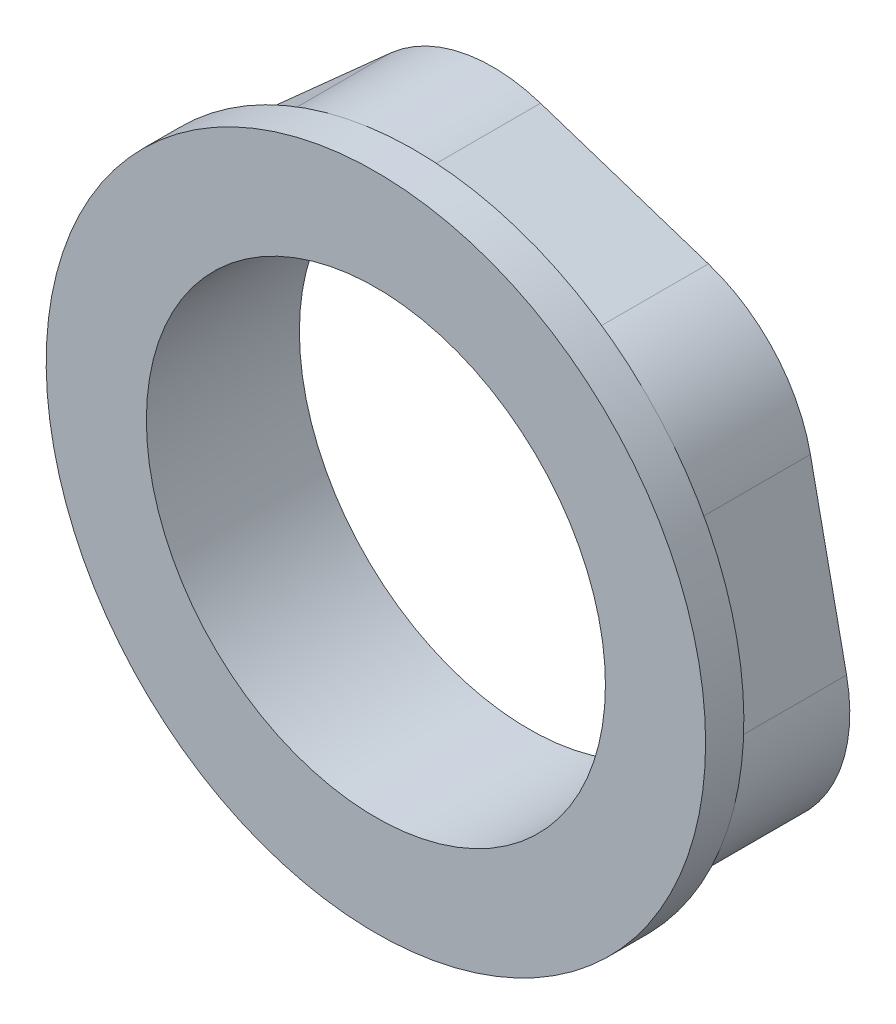
ISO-10303-21;
HEADER;
FILE_DESCRIPTION(('STEP AP214'),'2;1');
FILE_NAME('part.step','',(''),(''),'','','');
FILE_SCHEMA(('AUTOMOTIVE_DESIGN { 1 0 10303 214 1 1 1 1 }'));
ENDSEC;
DATA;
#1=APPLICATION_CONTEXT('core data for automotive mechanical design processes');
#2=APPLICATION_PROTOCOL_DEFINITION('international standard','automotive_design',2000,#1);
#3=PRODUCT_CONTEXT('',#1,'mechanical');
#4=PRODUCT('Part','Part','',(#3));
#5=PRODUCT_RELATED_PRODUCT_CATEGORY('part','',(#4));
#6=PRODUCT_DEFINITION_FORMATION('','',#4);
#7=PRODUCT_DEFINITION_CONTEXT('part definition',#1,'design');
#8=PRODUCT_DEFINITION('design','',#6,#7);
#9=PRODUCT_DEFINITION_SHAPE('','',#8);
#10=(LENGTH_UNIT() NAMED_UNIT(*) SI_UNIT(.MILLI.,.METRE.));
#11=(NAMED_UNIT(*) PLANE_ANGLE_UNIT() SI_UNIT($,.RADIAN.));
#12=(NAMED_UNIT(*) SI_UNIT($,.STERADIAN.) SOLID_ANGLE_UNIT());
#13=UNCERTAINTY_MEASURE_WITH_UNIT(LENGTH_MEASURE(1.E-05),#10,'distance_accuracy_value','');
#14=(GEOMETRIC_REPRESENTATION_CONTEXT(3) GLOBAL_UNCERTAINTY_ASSIGNED_CONTEXT((#13)) GLOBAL_UNIT_ASSIGNED_CONTEXT((#10,
#11,#12)) REPRESENTATION_CONTEXT('',''));
#15=CARTESIAN_POINT('',(0.,0.,0.));
#16=DIRECTION('',(0.,0.,1.));
#17=DIRECTION('',(1.,0.,0.));
#18=AXIS2_PLACEMENT_3D('',#15,#16,#17);
#19=CARTESIAN_POINT('',(0.,0.,0.));
#20=DIRECTION('',(0.,0.,1.));
#21=DIRECTION('',(1.,0.,0.));
#22=AXIS2_PLACEMENT_3D('',#19,#20,#21);
#23=PLANE('',#22);
#24=DIRECTION('',(-0.745360779799942,-0.666661314263864,0.));
#25=VECTOR('',#24,1.);
#26=CARTESIAN_POINT('',(-4.72654134805958,22.6051573809699,0.));
#27=LINE('',#26,#25);
#28=CARTESIAN_POINT('',(-9.02988381666844,18.7561864884844,0.));
#29=VERTEX_POINT('',#28);
#30=CARTESIAN_POINT('',(-17.6365687538861,11.0582447035133,0.));
#31=VERTEX_POINT('',#30);
#32=EDGE_CURVE('E237',#29,#31,#27,.T.);
#33=ORIENTED_EDGE('',*,*,#32,.F.);
#34=CARTESIAN_POINT('',(-2.3632706740298,11.3025786904849,0.));
#35=DIRECTION('',(0.,0.,1.));
#36=DIRECTION('',(1.,0.,0.));
#37=AXIS2_PLACEMENT_3D('',#34,#35,#36);
#38=CIRCLE('',#37,10.);
#39=CARTESIAN_POINT('',(0.758436457564168,20.8028389282129,0.));
#40=VERTEX_POINT('',#39);
#41=EDGE_CURVE('E153',#29,#40,#38,.F.);
#42=ORIENTED_EDGE('',*,*,#41,.T.);
#43=DIRECTION('',(-0.950026023772798,0.312170713159396,0.));
#44=VECTOR('',#43,1.);
#45=CARTESIAN_POINT('',(17.2133698744354,15.3958835699421,0.));
#46=LINE('',#45,#44);
#47=CARTESIAN_POINT('',(11.7283920688117,17.198202022699,0.));
#48=VERTEX_POINT('',#47);
#49=EDGE_CURVE('E235',#48,#40,#46,.T.);
#50=ORIENTED_EDGE('',*,*,#49,.F.);
#51=CARTESIAN_POINT('',(8.60668493721771,7.69794178497103,0.));
#52=DIRECTION('',(0.,0.,1.));
#53=DIRECTION('',(1.,0.,0.));
#54=AXIS2_PLACEMENT_3D('',#51,#52,#53);
#55=CIRCLE('',#54,10.);
#56=CARTESIAN_POINT('',(18.3950052114503,9.74459422469961,0.));
#57=VERTEX_POINT('',#56);
#58=EDGE_CURVE('E148',#48,#57,#55,.F.);
#59=ORIENTED_EDGE('',*,*,#58,.T.);
#60=DIRECTION('',(-0.204665243972857,0.978832027423261,0.));
#61=VECTOR('',#60,1.);
#62=CARTESIAN_POINT('',(21.939911222495,-7.20927381102781,0.));
#63=LINE('',#62,#61);
#64=CARTESIAN_POINT('',(20.7582758854801,-1.55798446578534,0.));
#65=VERTEX_POINT('',#64);
#66=EDGE_CURVE('E209',#65,#57,#63,.T.);
#67=ORIENTED_EDGE('',*,*,#66,.F.);
#68=CARTESIAN_POINT('',(10.9699556112475,-3.60463690551391,0.));
#69=DIRECTION('',(0.,0.,1.));
#70=DIRECTION('',(1.,0.,0.));
#71=AXIS2_PLACEMENT_3D('',#68,#69,#70);
#72=CIRCLE('',#71,10.);
#73=CARTESIAN_POINT('',(17.6365687538861,-11.0582447035133,0.));
#74=VERTEX_POINT('',#73);
#75=EDGE_CURVE('E248',#65,#74,#72,.F.);
#76=ORIENTED_EDGE('',*,*,#75,.T.);
#77=DIRECTION('',(0.745360779799942,0.666661314263864,0.));
#78=VECTOR('',#77,1.);
#79=CARTESIAN_POINT('',(4.72654134805957,-22.6051573809699,0.));
#80=LINE('',#79,#78);
#81=CARTESIAN_POINT('',(9.02988381666843,-18.7561864884844,0.));
#82=VERTEX_POINT('',#81);
#83=EDGE_CURVE('E230',#82,#74,#80,.T.);
#84=ORIENTED_EDGE('',*,*,#83,.F.);
#85=CARTESIAN_POINT('',(2.36327067402979,-11.3025786904849,0.));
#86=DIRECTION('',(0.,0.,1.));
#87=DIRECTION('',(1.,0.,0.));
#88=AXIS2_PLACEMENT_3D('',#85,#86,#87);
#89=CIRCLE('',#88,10.);
#90=CARTESIAN_POINT('',(-0.758436457564179,-20.8028389282129,0.));
#91=VERTEX_POINT('',#90);
#92=EDGE_CURVE('E250',#82,#91,#89,.F.);
#93=ORIENTED_EDGE('',*,*,#92,.T.);
#94=DIRECTION('',(0.950026023772798,-0.312170713159396,0.));
#95=VECTOR('',#94,1.);
#96=CARTESIAN_POINT('',(-17.2133698744354,-15.3958835699421,0.));
#97=LINE('',#96,#95);
#98=CARTESIAN_POINT('',(-11.7283920688117,-17.198202022699,0.));
#99=VERTEX_POINT('',#98);
#100=EDGE_CURVE('E227',#99,#91,#97,.T.);
#101=ORIENTED_EDGE('',*,*,#100,.F.);
#102=CARTESIAN_POINT('',(-8.60668493721772,-7.69794178497103,0.));
#103=DIRECTION('',(0.,0.,1.));
#104=DIRECTION('',(1.,0.,0.));
#105=AXIS2_PLACEMENT_3D('',#102,#103,#104);
#106=CIRCLE('',#105,10.);
#107=CARTESIAN_POINT('',(-18.3950052114503,-9.74459422469961,0.));
#108=VERTEX_POINT('',#107);
#109=EDGE_CURVE('E252',#99,#108,#106,.F.);
#110=ORIENTED_EDGE('',*,*,#109,.T.);
#111=DIRECTION('',(0.204665243972857,-0.978832027423261,0.));
#112=VECTOR('',#111,1.);
#113=CARTESIAN_POINT('',(-21.939911222495,7.20927381102781,0.));
#114=LINE('',#113,#112);
#115=CARTESIAN_POINT('',(-20.7582758854801,1.55798446578534,0.));
#116=VERTEX_POINT('',#115);
#117=EDGE_CURVE('E240',#116,#108,#114,.T.);
#118=ORIENTED_EDGE('',*,*,#117,.F.);
#119=CARTESIAN_POINT('',(-10.9699556112475,3.60463690551391,0.));
#120=DIRECTION('',(0.,0.,1.));
#121=DIRECTION('',(1.,0.,0.));
#122=AXIS2_PLACEMENT_3D('',#119,#120,#121);
#123=CIRCLE('',#122,10.);
#124=EDGE_CURVE('E254',#116,#31,#123,.F.);
#125=ORIENTED_EDGE('',*,*,#124,.T.);
#126=EDGE_LOOP('',(#33,#42,#50,#59,#67,#76,#84,#93,#101,#110,#118,#125));
#127=FACE_BOUND('',#126,.T.);
#128=CARTESIAN_POINT('',(0.,0.,0.));
#129=DIRECTION('',(0.,0.,1.));
#130=DIRECTION('',(1.,0.,0.));
#131=AXIS2_PLACEMENT_3D('',#128,#129,#130);
#132=CIRCLE('',#131,15.);
#133=CARTESIAN_POINT('',(15.,0.,0.));
#134=VERTEX_POINT('',#133);
#135=EDGE_CURVE('E231',#134,#134,#132,.T.);
#136=ORIENTED_EDGE('',*,*,#135,.T.);
#137=EDGE_LOOP('',(#136));
#138=FACE_BOUND('',#137,.T.);
#139=ADVANCED_FACE('F37',(#127,#138),#23,.F.);
#140=CARTESIAN_POINT('',(-17.2133698744354,-15.3958835699421,7.5));
#141=DIRECTION('',(0.312170713159396,0.950026023772799,0.));
#142=DIRECTION('',(-0.950026023772799,0.312170713159396,0.));
#143=AXIS2_PLACEMENT_3D('',#140,#141,#142);
#144=PLANE('',#143);
#145=DIRECTION('',(0.950026023772798,-0.312170713159396,0.));
#146=VECTOR('',#145,1.);
#147=CARTESIAN_POINT('',(-17.2133698744354,-15.3958835699421,7.5));
#148=LINE('',#147,#146);
#149=CARTESIAN_POINT('',(-11.7283920688117,-17.198202022699,7.5));
#150=VERTEX_POINT('',#149);
#151=CARTESIAN_POINT('',(-0.758436457564179,-20.8028389282129,7.5));
#152=VERTEX_POINT('',#151);
#153=EDGE_CURVE('E217',#150,#152,#148,.T.);
#154=ORIENTED_EDGE('',*,*,#153,.F.);
#155=DIRECTION('',(0.,0.,-1.));
#156=VECTOR('',#155,1.);
#157=CARTESIAN_POINT('',(-11.7283920688117,-17.198202022699,7.5));
#158=LINE('',#157,#156);
#159=EDGE_CURVE('E197',#150,#99,#158,.T.);
#160=ORIENTED_EDGE('',*,*,#159,.T.);
#161=ORIENTED_EDGE('',*,*,#100,.T.);
#162=DIRECTION('',(0.,0.,-1.));
#163=VECTOR('',#162,1.);
#164=CARTESIAN_POINT('',(-0.758436457564175,-20.8028389282129,7.5));
#165=LINE('',#164,#163);
#166=EDGE_CURVE('E195',#91,#152,#165,.F.);
#167=ORIENTED_EDGE('',*,*,#166,.T.);
#168=EDGE_LOOP('',(#154,#160,#161,#167));
#169=FACE_BOUND('',#168,.T.);
#170=ADVANCED_FACE('F303',(#169),#144,.F.);
#171=CARTESIAN_POINT('',(4.72654134805957,-22.6051573809699,7.5));
#172=DIRECTION('',(-0.666661314263864,0.745360779799942,0.));
#173=DIRECTION('',(-0.745360779799942,-0.666661314263864,0.));
#174=AXIS2_PLACEMENT_3D('',#171,#172,#173);
#175=PLANE('',#174);
#176=DIRECTION('',(0.745360779799942,0.666661314263864,0.));
#177=VECTOR('',#176,1.);
#178=CARTESIAN_POINT('',(4.72654134805957,-22.6051573809699,7.5));
#179=LINE('',#178,#177);
#180=CARTESIAN_POINT('',(9.02988381666843,-18.7561864884844,7.5));
#181=VERTEX_POINT('',#180);
#182=CARTESIAN_POINT('',(17.6365687538861,-11.0582447035133,7.5));
#183=VERTEX_POINT('',#182);
#184=EDGE_CURVE('E214',#181,#183,#179,.T.);
#185=ORIENTED_EDGE('',*,*,#184,.F.);
#186=DIRECTION('',(0.,0.,-1.));
#187=VECTOR('',#186,1.);
#188=CARTESIAN_POINT('',(9.02988381666843,-18.7561864884844,7.5));
#189=LINE('',#188,#187);
#190=EDGE_CURVE('E202',#181,#82,#189,.T.);
#191=ORIENTED_EDGE('',*,*,#190,.T.);
#192=ORIENTED_EDGE('',*,*,#83,.T.);
#193=DIRECTION('',(0.,0.,-1.));
#194=VECTOR('',#193,1.);
#195=CARTESIAN_POINT('',(17.6365687538861,-11.0582447035133,7.5));
#196=LINE('',#195,#194);
#197=EDGE_CURVE('E200',#74,#183,#196,.F.);
#198=ORIENTED_EDGE('',*,*,#197,.T.);
#199=EDGE_LOOP('',(#185,#191,#192,#198));
#200=FACE_BOUND('',#199,.T.);
#201=ADVANCED_FACE('F308',(#200),#175,.F.);
#202=CARTESIAN_POINT('',(21.939911222495,-7.20927381102781,7.5));
#203=DIRECTION('',(-0.978832027423261,-0.204665243972857,0.));
#204=DIRECTION('',(0.204665243972857,-0.978832027423261,0.));
#205=AXIS2_PLACEMENT_3D('',#202,#203,#204);
#206=PLANE('',#205);
#207=DIRECTION('',(-0.204665243972857,0.978832027423261,0.));
#208=VECTOR('',#207,1.);
#209=CARTESIAN_POINT('',(21.939911222495,-7.20927381102781,7.5));
#210=LINE('',#209,#208);
#211=CARTESIAN_POINT('',(20.7582758854801,-1.55798446578534,7.5));
#212=VERTEX_POINT('',#211);
#213=CARTESIAN_POINT('',(18.3950052114503,9.74459422469961,7.5));
#214=VERTEX_POINT('',#213);
#215=EDGE_CURVE('E163',#212,#214,#210,.T.);
#216=ORIENTED_EDGE('',*,*,#215,.F.);
#217=DIRECTION('',(0.,0.,-1.));
#218=VECTOR('',#217,1.);
#219=CARTESIAN_POINT('',(20.7582758854801,-1.55798446578534,7.5));
#220=LINE('',#219,#218);
#221=EDGE_CURVE('E11',#212,#65,#220,.T.);
#222=ORIENTED_EDGE('',*,*,#221,.T.);
#223=ORIENTED_EDGE('',*,*,#66,.T.);
#224=DIRECTION('',(0.,0.,-1.));
#225=VECTOR('',#224,1.);
#226=CARTESIAN_POINT('',(18.3950052114503,9.74459422469961,7.5));
#227=LINE('',#226,#225);
#228=EDGE_CURVE('E45',#57,#214,#227,.F.);
#229=ORIENTED_EDGE('',*,*,#228,.T.);
#230=EDGE_LOOP('',(#216,#222,#223,#229));
#231=FACE_BOUND('',#230,.T.);
#232=ADVANCED_FACE('F206',(#231),#206,.F.);
#233=CARTESIAN_POINT('',(17.2133698744354,15.3958835699421,7.5));
#234=DIRECTION('',(-0.312170713159396,-0.950026023772799,0.));
#235=DIRECTION('',(0.950026023772799,-0.312170713159396,0.));
#236=AXIS2_PLACEMENT_3D('',#233,#234,#235);
#237=PLANE('',#236);
#238=ORIENTED_EDGE('',*,*,#49,.T.);
#239=DIRECTION('',(0.,0.,-1.));
#240=VECTOR('',#239,1.);
#241=CARTESIAN_POINT('',(0.758436457564168,20.8028389282129,7.5));
#242=LINE('',#241,#240);
#243=CARTESIAN_POINT('',(0.758436457564168,20.8028389282129,7.5));
#244=VERTEX_POINT('',#243);
#245=EDGE_CURVE('E152',#40,#244,#242,.F.);
#246=ORIENTED_EDGE('',*,*,#245,.T.);
#247=DIRECTION('',(-0.950026023772798,0.312170713159396,0.));
#248=VECTOR('',#247,1.);
#249=CARTESIAN_POINT('',(17.2133698744354,15.3958835699421,7.5));
#250=LINE('',#249,#248);
#251=CARTESIAN_POINT('',(11.7283920688117,17.198202022699,7.5));
#252=VERTEX_POINT('',#251);
#253=EDGE_CURVE('E156',#252,#244,#250,.T.);
#254=ORIENTED_EDGE('',*,*,#253,.F.);
#255=DIRECTION('',(0.,0.,-1.));
#256=VECTOR('',#255,1.);
#257=CARTESIAN_POINT('',(11.7283920688117,17.198202022699,7.5));
#258=LINE('',#257,#256);
#259=EDGE_CURVE('E145',#252,#48,#258,.T.);
#260=ORIENTED_EDGE('',*,*,#259,.T.);
#261=EDGE_LOOP('',(#238,#246,#254,#260));
#262=FACE_BOUND('',#261,.T.);
#263=ADVANCED_FACE('F157',(#262),#237,.F.);
#264=CARTESIAN_POINT('',(-4.72654134805958,22.6051573809699,7.5));
#265=DIRECTION('',(0.666661314263864,-0.745360779799942,0.));
#266=DIRECTION('',(0.745360779799942,0.666661314263864,0.));
#267=AXIS2_PLACEMENT_3D('',#264,#265,#266);
#268=PLANE('',#267);
#269=DIRECTION('',(-0.745360779799942,-0.666661314263864,0.));
#270=VECTOR('',#269,1.);
#271=CARTESIAN_POINT('',(-4.72654134805958,22.6051573809699,7.5));
#272=LINE('',#271,#270);
#273=CARTESIAN_POINT('',(-9.02988381666844,18.7561864884844,7.5));
#274=VERTEX_POINT('',#273);
#275=CARTESIAN_POINT('',(-17.6365687538861,11.0582447035133,7.5));
#276=VERTEX_POINT('',#275);
#277=EDGE_CURVE('E162',#274,#276,#272,.T.);
#278=ORIENTED_EDGE('',*,*,#277,.F.);
#279=DIRECTION('',(0.,0.,-1.));
#280=VECTOR('',#279,1.);
#281=CARTESIAN_POINT('',(-9.02988381666844,18.7561864884844,7.5));
#282=LINE('',#281,#280);
#283=EDGE_CURVE('E244',#274,#29,#282,.T.);
#284=ORIENTED_EDGE('',*,*,#283,.T.);
#285=ORIENTED_EDGE('',*,*,#32,.T.);
#286=DIRECTION('',(0.,0.,-1.));
#287=VECTOR('',#286,1.);
#288=CARTESIAN_POINT('',(-17.6365687538861,11.0582447035133,7.5));
#289=LINE('',#288,#287);
#290=EDGE_CURVE('E226',#31,#276,#289,.F.);
#291=ORIENTED_EDGE('',*,*,#290,.T.);
#292=EDGE_LOOP('',(#278,#284,#285,#291));
#293=FACE_BOUND('',#292,.T.);
#294=ADVANCED_FACE('F317',(#293),#268,.F.);
#295=CARTESIAN_POINT('',(-21.939911222495,7.20927381102781,7.5));
#296=DIRECTION('',(0.978832027423261,0.204665243972857,0.));
#297=DIRECTION('',(-0.204665243972857,0.978832027423261,0.));
#298=AXIS2_PLACEMENT_3D('',#295,#296,#297);
#299=PLANE('',#298);
#300=DIRECTION('',(0.204665243972857,-0.978832027423261,0.));
#301=VECTOR('',#300,1.);
#302=CARTESIAN_POINT('',(-21.939911222495,7.20927381102781,7.5));
#303=LINE('',#302,#301);
#304=CARTESIAN_POINT('',(-20.7582758854801,1.55798446578534,7.5));
#305=VERTEX_POINT('',#304);
#306=CARTESIAN_POINT('',(-18.3950052114503,-9.74459422469961,7.5));
#307=VERTEX_POINT('',#306);
#308=EDGE_CURVE('E223',#305,#307,#303,.T.);
#309=ORIENTED_EDGE('',*,*,#308,.F.);
#310=DIRECTION('',(0.,0.,-1.));
#311=VECTOR('',#310,1.);
#312=CARTESIAN_POINT('',(-20.7582758854801,1.55798446578534,7.5));
#313=LINE('',#312,#311);
#314=EDGE_CURVE('E192',#305,#116,#313,.T.);
#315=ORIENTED_EDGE('',*,*,#314,.T.);
#316=ORIENTED_EDGE('',*,*,#117,.T.);
#317=DIRECTION('',(0.,0.,-1.));
#318=VECTOR('',#317,1.);
#319=CARTESIAN_POINT('',(-18.3950052114503,-9.74459422469961,7.5));
#320=LINE('',#319,#318);
#321=EDGE_CURVE('E190',#108,#307,#320,.F.);
#322=ORIENTED_EDGE('',*,*,#321,.T.);
#323=EDGE_LOOP('',(#309,#315,#316,#322));
#324=FACE_BOUND('',#323,.T.);
#325=ADVANCED_FACE('F314',(#324),#299,.F.);
#326=CARTESIAN_POINT('',(0.,0.,7.5));
#327=DIRECTION('',(0.,0.,-1.));
#328=DIRECTION('',(-1.,0.,0.));
#329=AXIS2_PLACEMENT_3D('',#326,#327,#328);
#330=CYLINDRICAL_SURFACE('',#329,15.);
#331=ORIENTED_EDGE('',*,*,#135,.F.);
#332=EDGE_LOOP('',(#331));
#333=FACE_BOUND('',#332,.T.);
#334=CARTESIAN_POINT('',(0.,0.,10.));
#335=DIRECTION('',(0.,0.,1.));
#336=DIRECTION('',(1.,0.,0.));
#337=AXIS2_PLACEMENT_3D('',#334,#335,#336);
#338=CIRCLE('',#337,15.);
#339=CARTESIAN_POINT('',(15.,0.,10.));
#340=VERTEX_POINT('',#339);
#341=EDGE_CURVE('E282',#340,#340,#338,.T.);
#342=ORIENTED_EDGE('',*,*,#341,.T.);
#343=EDGE_LOOP('',(#342));
#344=FACE_BOUND('',#343,.T.);
#345=ADVANCED_FACE('F288',(#333,#344),#330,.F.);
#346=CARTESIAN_POINT('',(-2.3632706740298,11.3025786904849,7.5));
#347=DIRECTION('',(0.,0.,-1.));
#348=DIRECTION('',(-1.,0.,0.));
#349=AXIS2_PLACEMENT_3D('',#346,#347,#348);
#350=CYLINDRICAL_SURFACE('',#349,10.);
#351=CARTESIAN_POINT('',(-2.3632706740298,11.3025786904849,7.5));
#352=DIRECTION('',(0.,0.,1.));
#353=DIRECTION('',(1.,0.,0.));
#354=AXIS2_PLACEMENT_3D('',#351,#352,#353);
#355=CIRCLE('',#354,10.);
#356=CARTESIAN_POINT('',(-4.40992311375837,21.0908989647175,7.5));
#357=VERTEX_POINT('',#356);
#358=EDGE_CURVE('E188',#244,#357,#355,.T.);
#359=ORIENTED_EDGE('',*,*,#358,.F.);
#360=ORIENTED_EDGE('',*,*,#245,.F.);
#361=ORIENTED_EDGE('',*,*,#41,.F.);
#362=ORIENTED_EDGE('',*,*,#283,.F.);
#363=EDGE_CURVE('E187',#357,#274,#355,.T.);
#364=ORIENTED_EDGE('',*,*,#363,.F.);
#365=EDGE_LOOP('',(#359,#360,#361,#362,#364));
#366=FACE_BOUND('',#365,.T.);
#367=ADVANCED_FACE('F261',(#366),#350,.T.);
#368=CARTESIAN_POINT('',(-10.9699556112475,3.60463690551391,7.5));
#369=DIRECTION('',(0.,0.,-1.));
#370=DIRECTION('',(-1.,0.,0.));
#371=AXIS2_PLACEMENT_3D('',#368,#369,#370);
#372=CYLINDRICAL_SURFACE('',#371,10.);
#373=CARTESIAN_POINT('',(-10.9699556112475,3.60463690551391,7.5));
#374=DIRECTION('',(0.,0.,1.));
#375=DIRECTION('',(1.,0.,0.));
#376=AXIS2_PLACEMENT_3D('',#373,#374,#375);
#377=CIRCLE('',#376,10.);
#378=CARTESIAN_POINT('',(-20.4702158489755,6.72634403710787,7.5));
#379=VERTEX_POINT('',#378);
#380=EDGE_CURVE('E184',#276,#379,#377,.T.);
#381=ORIENTED_EDGE('',*,*,#380,.F.);
#382=ORIENTED_EDGE('',*,*,#290,.F.);
#383=ORIENTED_EDGE('',*,*,#124,.F.);
#384=ORIENTED_EDGE('',*,*,#314,.F.);
#385=EDGE_CURVE('E183',#379,#305,#377,.T.);
#386=ORIENTED_EDGE('',*,*,#385,.F.);
#387=EDGE_LOOP('',(#381,#382,#383,#384,#386));
#388=FACE_BOUND('',#387,.T.);
#389=ADVANCED_FACE('F331',(#388),#372,.T.);
#390=CARTESIAN_POINT('',(-8.60668493721772,-7.69794178497103,7.5));
#391=DIRECTION('',(0.,0.,-1.));
#392=DIRECTION('',(-1.,0.,0.));
#393=AXIS2_PLACEMENT_3D('',#390,#391,#392);
#394=CYLINDRICAL_SURFACE('',#393,10.);
#395=CARTESIAN_POINT('',(-8.60668493721772,-7.69794178497103,7.5));
#396=DIRECTION('',(0.,0.,1.));
#397=DIRECTION('',(1.,0.,0.));
#398=AXIS2_PLACEMENT_3D('',#395,#396,#397);
#399=CIRCLE('',#398,10.);
#400=CARTESIAN_POINT('',(-16.0602927352171,-14.3645549276097,7.5));
#401=VERTEX_POINT('',#400);
#402=EDGE_CURVE('E180',#307,#401,#399,.T.);
#403=ORIENTED_EDGE('',*,*,#402,.F.);
#404=ORIENTED_EDGE('',*,*,#321,.F.);
#405=ORIENTED_EDGE('',*,*,#109,.F.);
#406=ORIENTED_EDGE('',*,*,#159,.F.);
#407=EDGE_CURVE('E179',#401,#150,#399,.T.);
#408=ORIENTED_EDGE('',*,*,#407,.F.);
#409=EDGE_LOOP('',(#403,#404,#405,#406,#408));
#410=FACE_BOUND('',#409,.T.);
#411=ADVANCED_FACE('F334',(#410),#394,.T.);
#412=CARTESIAN_POINT('',(2.36327067402979,-11.3025786904849,7.5));
#413=DIRECTION('',(0.,0.,-1.));
#414=DIRECTION('',(-1.,0.,0.));
#415=AXIS2_PLACEMENT_3D('',#412,#413,#414);
#416=CYLINDRICAL_SURFACE('',#415,10.);
#417=CARTESIAN_POINT('',(2.36327067402979,-11.3025786904849,7.5));
#418=DIRECTION('',(0.,0.,1.));
#419=DIRECTION('',(1.,0.,0.));
#420=AXIS2_PLACEMENT_3D('',#417,#418,#419);
#421=CIRCLE('',#420,10.);
#422=CARTESIAN_POINT('',(4.40992311375835,-21.0908989647175,7.5));
#423=VERTEX_POINT('',#422);
#424=EDGE_CURVE('E176',#152,#423,#421,.T.);
#425=ORIENTED_EDGE('',*,*,#424,.F.);
#426=ORIENTED_EDGE('',*,*,#166,.F.);
#427=ORIENTED_EDGE('',*,*,#92,.F.);
#428=ORIENTED_EDGE('',*,*,#190,.F.);
#429=EDGE_CURVE('E175',#423,#181,#421,.T.);
#430=ORIENTED_EDGE('',*,*,#429,.F.);
#431=EDGE_LOOP('',(#425,#426,#427,#428,#430));
#432=FACE_BOUND('',#431,.T.);
#433=ADVANCED_FACE('F338',(#432),#416,.T.);
#434=CARTESIAN_POINT('',(10.9699556112475,-3.60463690551391,7.5));
#435=DIRECTION('',(0.,0.,-1.));
#436=DIRECTION('',(-1.,0.,0.));
#437=AXIS2_PLACEMENT_3D('',#434,#435,#436);
#438=CYLINDRICAL_SURFACE('',#437,10.);
#439=CARTESIAN_POINT('',(10.9699556112475,-3.60463690551391,7.5));
#440=DIRECTION('',(0.,0.,1.));
#441=DIRECTION('',(1.,0.,0.));
#442=AXIS2_PLACEMENT_3D('',#439,#440,#441);
#443=CIRCLE('',#442,10.);
#444=CARTESIAN_POINT('',(20.4702158489755,-6.72634403710788,7.5));
#445=VERTEX_POINT('',#444);
#446=EDGE_CURVE('E173',#183,#445,#443,.T.);
#447=ORIENTED_EDGE('',*,*,#446,.F.);
#448=ORIENTED_EDGE('',*,*,#197,.F.);
#449=ORIENTED_EDGE('',*,*,#75,.F.);
#450=ORIENTED_EDGE('',*,*,#221,.F.);
#451=EDGE_CURVE('E60',#445,#212,#443,.T.);
#452=ORIENTED_EDGE('',*,*,#451,.F.);
#453=EDGE_LOOP('',(#447,#448,#449,#450,#452));
#454=FACE_BOUND('',#453,.T.);
#455=ADVANCED_FACE('F341',(#454),#438,.T.);
#456=CARTESIAN_POINT('',(8.60668493721771,7.69794178497103,7.5));
#457=DIRECTION('',(0.,0.,-1.));
#458=DIRECTION('',(-1.,0.,0.));
#459=AXIS2_PLACEMENT_3D('',#456,#457,#458);
#460=CYLINDRICAL_SURFACE('',#459,10.);
#461=CARTESIAN_POINT('',(8.60668493721771,7.69794178497103,7.5));
#462=DIRECTION('',(0.,0.,1.));
#463=DIRECTION('',(1.,0.,0.));
#464=AXIS2_PLACEMENT_3D('',#461,#462,#463);
#465=CIRCLE('',#464,10.);
#466=CARTESIAN_POINT('',(16.0602927352171,14.3645549276097,7.5));
#467=VERTEX_POINT('',#466);
#468=EDGE_CURVE('E169',#214,#467,#465,.T.);
#469=ORIENTED_EDGE('',*,*,#468,.F.);
#470=ORIENTED_EDGE('',*,*,#228,.F.);
#471=ORIENTED_EDGE('',*,*,#58,.F.);
#472=ORIENTED_EDGE('',*,*,#259,.F.);
#473=EDGE_CURVE('E52',#467,#252,#465,.T.);
#474=ORIENTED_EDGE('',*,*,#473,.F.);
#475=EDGE_LOOP('',(#469,#470,#471,#472,#474));
#476=FACE_BOUND('',#475,.T.);
#477=ADVANCED_FACE('F39',(#476),#460,.T.);
#478=CARTESIAN_POINT('',(0.,0.,7.5));
#479=DIRECTION('',(0.,0.,1.));
#480=DIRECTION('',(1.,0.,0.));
#481=AXIS2_PLACEMENT_3D('',#478,#479,#480);
#482=PLANE('',#481);
#483=ORIENTED_EDGE('',*,*,#473,.T.);
#484=ORIENTED_EDGE('',*,*,#253,.T.);
#485=ORIENTED_EDGE('',*,*,#358,.T.);
#486=CARTESIAN_POINT('',(0.,0.,7.5));
#487=DIRECTION('',(0.,0.,1.));
#488=DIRECTION('',(1.,0.,0.));
#489=AXIS2_PLACEMENT_3D('',#486,#487,#488);
#490=CIRCLE('',#489,21.5470053837925);
#491=EDGE_CURVE('E168',#467,#357,#490,.T.);
#492=ORIENTED_EDGE('',*,*,#491,.F.);
#493=EDGE_LOOP('',(#483,#484,#485,#492));
#494=FACE_BOUND('',#493,.T.);
#495=ADVANCED_FACE('F166',(#494),#482,.F.);
#496=EDGE_CURVE('E266',#357,#379,#490,.T.);
#497=ORIENTED_EDGE('',*,*,#496,.F.);
#498=ORIENTED_EDGE('',*,*,#363,.T.);
#499=ORIENTED_EDGE('',*,*,#277,.T.);
#500=ORIENTED_EDGE('',*,*,#380,.T.);
#501=EDGE_LOOP('',(#497,#498,#499,#500));
#502=FACE_BOUND('',#501,.T.);
#503=ADVANCED_FACE('F267',(#502),#482,.F.);
#504=EDGE_CURVE('E272',#379,#401,#490,.T.);
#505=ORIENTED_EDGE('',*,*,#504,.F.);
#506=ORIENTED_EDGE('',*,*,#385,.T.);
#507=ORIENTED_EDGE('',*,*,#308,.T.);
#508=ORIENTED_EDGE('',*,*,#402,.T.);
#509=EDGE_LOOP('',(#505,#506,#507,#508));
#510=FACE_BOUND('',#509,.T.);
#511=ADVANCED_FACE('F365',(#510),#482,.F.);
#512=EDGE_CURVE('E283',#401,#423,#490,.T.);
#513=ORIENTED_EDGE('',*,*,#512,.F.);
#514=ORIENTED_EDGE('',*,*,#407,.T.);
#515=ORIENTED_EDGE('',*,*,#153,.T.);
#516=ORIENTED_EDGE('',*,*,#424,.T.);
#517=EDGE_LOOP('',(#513,#514,#515,#516));
#518=FACE_BOUND('',#517,.T.);
#519=ADVANCED_FACE('F300',(#518),#482,.F.);
#520=EDGE_CURVE('E281',#423,#445,#490,.T.);
#521=ORIENTED_EDGE('',*,*,#520,.F.);
#522=ORIENTED_EDGE('',*,*,#429,.T.);
#523=ORIENTED_EDGE('',*,*,#184,.T.);
#524=ORIENTED_EDGE('',*,*,#446,.T.);
#525=EDGE_LOOP('',(#521,#522,#523,#524));
#526=FACE_BOUND('',#525,.T.);
#527=ADVANCED_FACE('F292',(#526),#482,.F.);
#528=CARTESIAN_POINT('',(0.,0.,10.));
#529=DIRECTION('',(0.,0.,1.));
#530=DIRECTION('',(1.,0.,0.));
#531=AXIS2_PLACEMENT_3D('',#528,#529,#530);
#532=PLANE('',#531);
#533=CARTESIAN_POINT('',(0.,0.,10.));
#534=DIRECTION('',(0.,0.,1.));
#535=DIRECTION('',(1.,0.,0.));
#536=AXIS2_PLACEMENT_3D('',#533,#534,#535);
#537=CIRCLE('',#536,21.5470053837925);
#538=CARTESIAN_POINT('',(21.5470053837925,0.,10.));
#539=VERTEX_POINT('',#538);
#540=EDGE_CURVE('E277',#539,#539,#537,.T.);
#541=ORIENTED_EDGE('',*,*,#540,.T.);
#542=EDGE_LOOP('',(#541));
#543=FACE_BOUND('',#542,.T.);
#544=ORIENTED_EDGE('',*,*,#341,.F.);
#545=EDGE_LOOP('',(#544));
#546=FACE_BOUND('',#545,.T.);
#547=ADVANCED_FACE('F290',(#543,#546),#532,.T.);
#548=EDGE_CURVE('E276',#445,#467,#490,.T.);
#549=ORIENTED_EDGE('',*,*,#548,.F.);
#550=ORIENTED_EDGE('',*,*,#451,.T.);
#551=ORIENTED_EDGE('',*,*,#215,.T.);
#552=ORIENTED_EDGE('',*,*,#468,.T.);
#553=EDGE_LOOP('',(#549,#550,#551,#552));
#554=FACE_BOUND('',#553,.T.);
#555=ADVANCED_FACE('F213',(#554),#482,.F.);
#556=CARTESIAN_POINT('',(0.,0.,10.));
#557=DIRECTION('',(0.,0.,-1.));
#558=DIRECTION('',(-1.,0.,0.));
#559=AXIS2_PLACEMENT_3D('',#556,#557,#558);
#560=CYLINDRICAL_SURFACE('',#559,21.5470053837925);
#561=ORIENTED_EDGE('',*,*,#540,.F.);
#562=EDGE_LOOP('',(#561));
#563=FACE_BOUND('',#562,.T.);
#564=ORIENTED_EDGE('',*,*,#491,.T.);
#565=ORIENTED_EDGE('',*,*,#496,.T.);
#566=ORIENTED_EDGE('',*,*,#504,.T.);
#567=ORIENTED_EDGE('',*,*,#512,.T.);
#568=ORIENTED_EDGE('',*,*,#520,.T.);
#569=ORIENTED_EDGE('',*,*,#548,.T.);
#570=EDGE_LOOP('',(#564,#565,#566,#567,#568,#569));
#571=FACE_BOUND('',#570,.T.);
#572=ADVANCED_FACE('F274',(#563,#571),#560,.T.);
#573=CLOSED_SHELL('',(#139,#170,#201,#232,#263,#294,#325,#345,#367,#389,#411,#433,#455,#477,
#495,#503,#511,#519,#527,#547,#555,#572));
#574=MANIFOLD_SOLID_BREP('B2',#573);
#575=ADVANCED_BREP_SHAPE_REPRESENTATION('',(#18,#574),#14);
#576=SHAPE_DEFINITION_REPRESENTATION(#9,#575);
ENDSEC;
END-ISO-10303-21;
